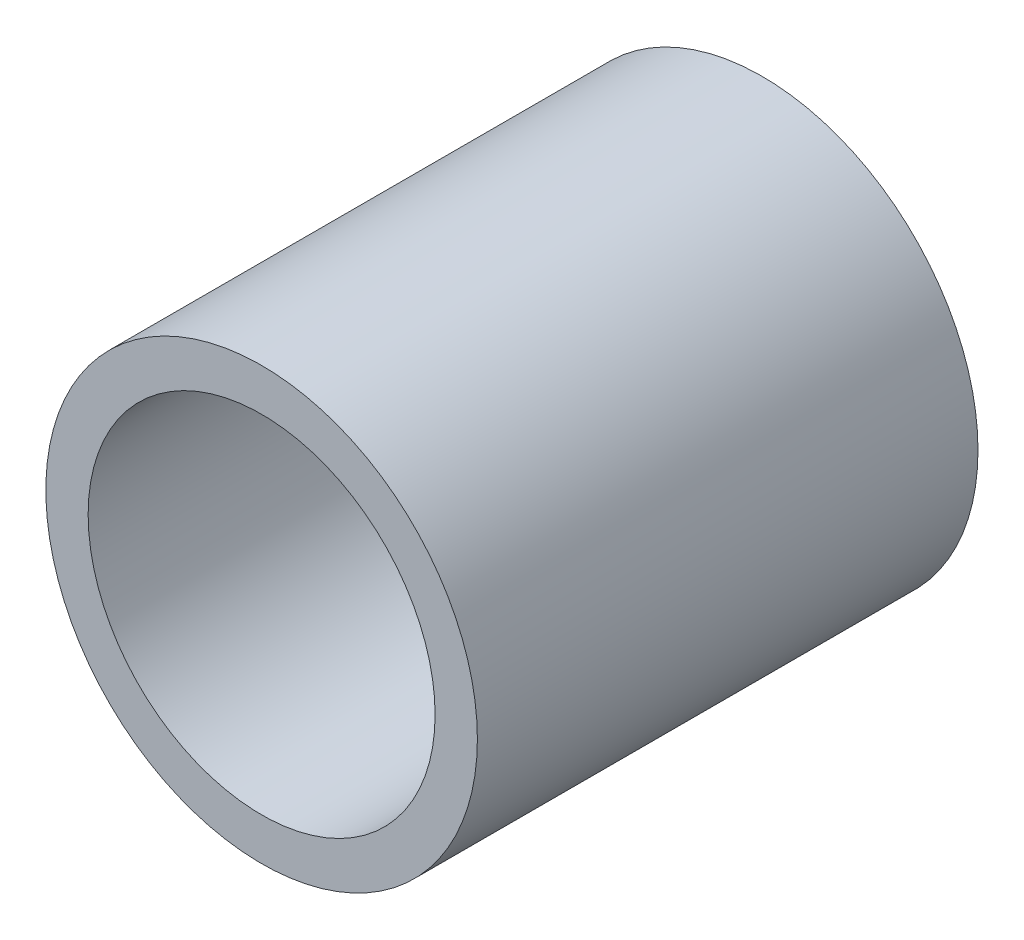
ISO-10303-21;
HEADER;
FILE_DESCRIPTION(('STEP AP214'),'2;1');
FILE_NAME('part.step','',(''),(''),'','','');
FILE_SCHEMA(('AUTOMOTIVE_DESIGN { 1 0 10303 214 1 1 1 1 }'));
ENDSEC;
DATA;
#1=APPLICATION_CONTEXT('core data for automotive mechanical design processes');
#2=APPLICATION_PROTOCOL_DEFINITION('international standard','automotive_design',2000,#1);
#3=PRODUCT_CONTEXT('',#1,'mechanical');
#4=PRODUCT('Part','Part','',(#3));
#5=PRODUCT_RELATED_PRODUCT_CATEGORY('part','',(#4));
#6=PRODUCT_DEFINITION_FORMATION('','',#4);
#7=PRODUCT_DEFINITION_CONTEXT('part definition',#1,'design');
#8=PRODUCT_DEFINITION('design','',#6,#7);
#9=PRODUCT_DEFINITION_SHAPE('','',#8);
#10=(LENGTH_UNIT() NAMED_UNIT(*) SI_UNIT(.MILLI.,.METRE.));
#11=(NAMED_UNIT(*) PLANE_ANGLE_UNIT() SI_UNIT($,.RADIAN.));
#12=(NAMED_UNIT(*) SI_UNIT($,.STERADIAN.) SOLID_ANGLE_UNIT());
#13=UNCERTAINTY_MEASURE_WITH_UNIT(LENGTH_MEASURE(1.E-05),#10,'distance_accuracy_value','');
#14=(GEOMETRIC_REPRESENTATION_CONTEXT(3) GLOBAL_UNCERTAINTY_ASSIGNED_CONTEXT((#13)) GLOBAL_UNIT_ASSIGNED_CONTEXT((#10,
#11,#12)) REPRESENTATION_CONTEXT('',''));
#15=CARTESIAN_POINT('',(0.,0.,0.));
#16=DIRECTION('',(0.,0.,1.));
#17=DIRECTION('',(1.,0.,0.));
#18=AXIS2_PLACEMENT_3D('',#15,#16,#17);
#19=CARTESIAN_POINT('',(0.,0.,7.366));
#20=DIRECTION('',(0.,0.,1.));
#21=DIRECTION('',(1.,0.,0.));
#22=AXIS2_PLACEMENT_3D('',#19,#20,#21);
#23=PLANE('',#22);
#24=CARTESIAN_POINT('',(0.,0.,7.366));
#25=DIRECTION('',(0.,0.,1.));
#26=DIRECTION('',(1.,0.,0.));
#27=AXIS2_PLACEMENT_3D('',#24,#25,#26);
#28=CIRCLE('',#27,6.35);
#29=CARTESIAN_POINT('',(6.35,0.,7.366));
#30=VERTEX_POINT('',#29);
#31=EDGE_CURVE('E10',#30,#30,#28,.T.);
#32=ORIENTED_EDGE('',*,*,#31,.T.);
#33=EDGE_LOOP('',(#32));
#34=FACE_BOUND('',#33,.T.);
#35=CARTESIAN_POINT('',(0.,0.,7.366));
#36=DIRECTION('',(0.,0.,1.));
#37=DIRECTION('',(1.,0.,0.));
#38=AXIS2_PLACEMENT_3D('',#35,#36,#37);
#39=CIRCLE('',#38,5.1054);
#40=CARTESIAN_POINT('',(5.1054,0.,7.366));
#41=VERTEX_POINT('',#40);
#42=EDGE_CURVE('E48',#41,#41,#39,.T.);
#43=ORIENTED_EDGE('',*,*,#42,.F.);
#44=EDGE_LOOP('',(#43));
#45=FACE_BOUND('',#44,.T.);
#46=ADVANCED_FACE('F37',(#34,#45),#23,.T.);
#47=CARTESIAN_POINT('',(0.,0.,-7.366));
#48=DIRECTION('',(0.,0.,1.));
#49=DIRECTION('',(1.,0.,0.));
#50=AXIS2_PLACEMENT_3D('',#47,#48,#49);
#51=PLANE('',#50);
#52=CARTESIAN_POINT('',(0.,0.,-7.366));
#53=DIRECTION('',(0.,0.,1.));
#54=DIRECTION('',(1.,0.,0.));
#55=AXIS2_PLACEMENT_3D('',#52,#53,#54);
#56=CIRCLE('',#55,6.35);
#57=CARTESIAN_POINT('',(6.35,0.,-7.366));
#58=VERTEX_POINT('',#57);
#59=EDGE_CURVE('E41',#58,#58,#56,.T.);
#60=ORIENTED_EDGE('',*,*,#59,.F.);
#61=EDGE_LOOP('',(#60));
#62=FACE_BOUND('',#61,.T.);
#63=CARTESIAN_POINT('',(0.,0.,-7.366));
#64=DIRECTION('',(0.,0.,1.));
#65=DIRECTION('',(1.,0.,0.));
#66=AXIS2_PLACEMENT_3D('',#63,#64,#65);
#67=CIRCLE('',#66,5.1054);
#68=CARTESIAN_POINT('',(5.1054,0.,-7.366));
#69=VERTEX_POINT('',#68);
#70=EDGE_CURVE('E50',#69,#69,#67,.T.);
#71=ORIENTED_EDGE('',*,*,#70,.T.);
#72=EDGE_LOOP('',(#71));
#73=FACE_BOUND('',#72,.T.);
#74=ADVANCED_FACE('F60',(#62,#73),#51,.F.);
#75=CARTESIAN_POINT('',(0.,0.,7.366));
#76=DIRECTION('',(0.,0.,-1.));
#77=DIRECTION('',(-1.,0.,0.));
#78=AXIS2_PLACEMENT_3D('',#75,#76,#77);
#79=CYLINDRICAL_SURFACE('',#78,6.35);
#80=ORIENTED_EDGE('',*,*,#31,.F.);
#81=EDGE_LOOP('',(#80));
#82=FACE_BOUND('',#81,.T.);
#83=ORIENTED_EDGE('',*,*,#59,.T.);
#84=EDGE_LOOP('',(#83));
#85=FACE_BOUND('',#84,.T.);
#86=ADVANCED_FACE('F39',(#82,#85),#79,.T.);
#87=CARTESIAN_POINT('',(0.,0.,7.366));
#88=DIRECTION('',(0.,0.,-1.));
#89=DIRECTION('',(-1.,0.,0.));
#90=AXIS2_PLACEMENT_3D('',#87,#88,#89);
#91=CYLINDRICAL_SURFACE('',#90,5.1054);
#92=ORIENTED_EDGE('',*,*,#42,.T.);
#93=EDGE_LOOP('',(#92));
#94=FACE_BOUND('',#93,.T.);
#95=ORIENTED_EDGE('',*,*,#70,.F.);
#96=EDGE_LOOP('',(#95));
#97=FACE_BOUND('',#96,.T.);
#98=ADVANCED_FACE('F56',(#94,#97),#91,.F.);
#99=CLOSED_SHELL('',(#46,#74,#86,#98));
#100=MANIFOLD_SOLID_BREP('B2',#99);
#101=ADVANCED_BREP_SHAPE_REPRESENTATION('',(#18,#100),#14);
#102=SHAPE_DEFINITION_REPRESENTATION(#9,#101);
ENDSEC;
END-ISO-10303-21;
